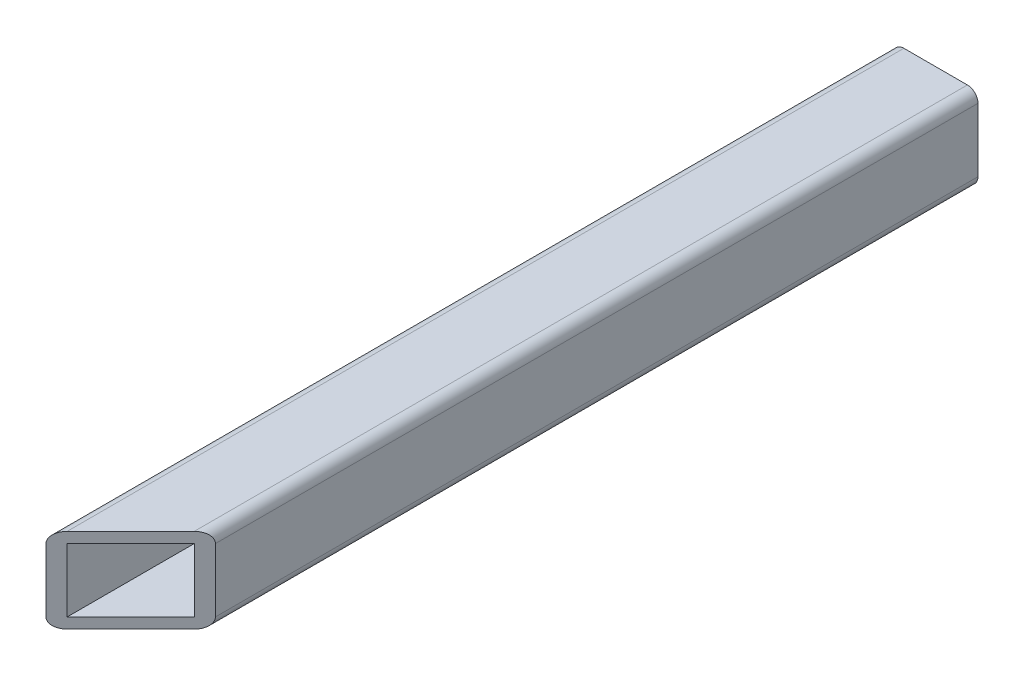
ISO-10303-21;
HEADER;
FILE_DESCRIPTION(('STEP AP214'),'2;1');
FILE_NAME('part.step','',(''),(''),'','','');
FILE_SCHEMA(('AUTOMOTIVE_DESIGN { 1 0 10303 214 1 1 1 1 }'));
ENDSEC;
DATA;
#1=APPLICATION_CONTEXT('core data for automotive mechanical design processes');
#2=APPLICATION_PROTOCOL_DEFINITION('international standard','automotive_design',2000,#1);
#3=PRODUCT_CONTEXT('',#1,'mechanical');
#4=PRODUCT('Part','Part','',(#3));
#5=PRODUCT_RELATED_PRODUCT_CATEGORY('part','',(#4));
#6=PRODUCT_DEFINITION_FORMATION('','',#4);
#7=PRODUCT_DEFINITION_CONTEXT('part definition',#1,'design');
#8=PRODUCT_DEFINITION('design','',#6,#7);
#9=PRODUCT_DEFINITION_SHAPE('','',#8);
#10=(LENGTH_UNIT() NAMED_UNIT(*) SI_UNIT(.MILLI.,.METRE.));
#11=(NAMED_UNIT(*) PLANE_ANGLE_UNIT() SI_UNIT($,.RADIAN.));
#12=(NAMED_UNIT(*) SI_UNIT($,.STERADIAN.) SOLID_ANGLE_UNIT());
#13=UNCERTAINTY_MEASURE_WITH_UNIT(LENGTH_MEASURE(1.E-05),#10,'distance_accuracy_value','');
#14=(GEOMETRIC_REPRESENTATION_CONTEXT(3) GLOBAL_UNCERTAINTY_ASSIGNED_CONTEXT((#13)) GLOBAL_UNIT_ASSIGNED_CONTEXT((#10,
#11,#12)) REPRESENTATION_CONTEXT('',''));
#15=CARTESIAN_POINT('',(0.,0.,0.));
#16=DIRECTION('',(0.,0.,1.));
#17=DIRECTION('',(1.,0.,0.));
#18=AXIS2_PLACEMENT_3D('',#15,#16,#17);
#19=CARTESIAN_POINT('',(0.,0.,0.));
#20=DIRECTION('',(0.,0.,-1.));
#21=DIRECTION('',(-1.,0.,0.));
#22=AXIS2_PLACEMENT_3D('',#19,#20,#21);
#23=PLANE('',#22);
#24=DIRECTION('',(0.,1.,0.));
#25=VECTOR('',#24,1.);
#26=CARTESIAN_POINT('',(12.7,0.,0.));
#27=LINE('',#26,#25);
#28=CARTESIAN_POINT('',(12.7,1.5875,0.));
#29=VERTEX_POINT('',#28);
#30=CARTESIAN_POINT('',(12.7,11.1125,0.));
#31=VERTEX_POINT('',#30);
#32=EDGE_CURVE('E179',#29,#31,#27,.T.);
#33=ORIENTED_EDGE('',*,*,#32,.F.);
#34=CARTESIAN_POINT('',(11.1125,1.5875,0.));
#35=DIRECTION('',(0.,0.,-1.));
#36=DIRECTION('',(-1.,0.,0.));
#37=AXIS2_PLACEMENT_3D('',#34,#35,#36);
#38=CIRCLE('',#37,1.5875);
#39=CARTESIAN_POINT('',(11.1125,0.,0.));
#40=VERTEX_POINT('',#39);
#41=EDGE_CURVE('E201',#29,#40,#38,.T.);
#42=ORIENTED_EDGE('',*,*,#41,.T.);
#43=DIRECTION('',(1.,0.,0.));
#44=VECTOR('',#43,1.);
#45=CARTESIAN_POINT('',(0.,0.,0.));
#46=LINE('',#45,#44);
#47=CARTESIAN_POINT('',(1.5875,0.,0.));
#48=VERTEX_POINT('',#47);
#49=EDGE_CURVE('E175',#48,#40,#46,.T.);
#50=ORIENTED_EDGE('',*,*,#49,.F.);
#51=CARTESIAN_POINT('',(1.5875,1.5875,0.));
#52=DIRECTION('',(0.,0.,-1.));
#53=DIRECTION('',(-1.,0.,0.));
#54=AXIS2_PLACEMENT_3D('',#51,#52,#53);
#55=CIRCLE('',#54,1.5875);
#56=CARTESIAN_POINT('',(0.,1.5875,0.));
#57=VERTEX_POINT('',#56);
#58=EDGE_CURVE('E198',#48,#57,#55,.T.);
#59=ORIENTED_EDGE('',*,*,#58,.T.);
#60=DIRECTION('',(0.,-1.,0.));
#61=VECTOR('',#60,1.);
#62=CARTESIAN_POINT('',(0.,0.,0.));
#63=LINE('',#62,#61);
#64=CARTESIAN_POINT('',(0.,11.1125,0.));
#65=VERTEX_POINT('',#64);
#66=EDGE_CURVE('E169',#65,#57,#63,.T.);
#67=ORIENTED_EDGE('',*,*,#66,.F.);
#68=CARTESIAN_POINT('',(1.5875,11.1125,0.));
#69=DIRECTION('',(0.,0.,-1.));
#70=DIRECTION('',(-1.,0.,0.));
#71=AXIS2_PLACEMENT_3D('',#68,#69,#70);
#72=CIRCLE('',#71,1.5875);
#73=CARTESIAN_POINT('',(1.5875,12.7,0.));
#74=VERTEX_POINT('',#73);
#75=EDGE_CURVE('E195',#65,#74,#72,.T.);
#76=ORIENTED_EDGE('',*,*,#75,.T.);
#77=DIRECTION('',(-1.,0.,0.));
#78=VECTOR('',#77,1.);
#79=CARTESIAN_POINT('',(0.,12.7,0.));
#80=LINE('',#79,#78);
#81=CARTESIAN_POINT('',(11.1125,12.7,0.));
#82=VERTEX_POINT('',#81);
#83=EDGE_CURVE('E172',#82,#74,#80,.T.);
#84=ORIENTED_EDGE('',*,*,#83,.F.);
#85=CARTESIAN_POINT('',(11.1125,11.1125,0.));
#86=DIRECTION('',(0.,0.,-1.));
#87=DIRECTION('',(-1.,0.,0.));
#88=AXIS2_PLACEMENT_3D('',#85,#86,#87);
#89=CIRCLE('',#88,1.5875);
#90=EDGE_CURVE('E192',#82,#31,#89,.T.);
#91=ORIENTED_EDGE('',*,*,#90,.T.);
#92=EDGE_LOOP('',(#33,#42,#50,#59,#67,#76,#84,#91));
#93=FACE_BOUND('',#92,.T.);
#94=DIRECTION('',(1.,0.,0.));
#95=VECTOR('',#94,1.);
#96=CARTESIAN_POINT('',(11.1125,1.5875,0.));
#97=LINE('',#96,#95);
#98=CARTESIAN_POINT('',(1.5875,1.5875,0.));
#99=VERTEX_POINT('',#98);
#100=CARTESIAN_POINT('',(11.1125,1.5875,0.));
#101=VERTEX_POINT('',#100);
#102=EDGE_CURVE('E155',#99,#101,#97,.T.);
#103=ORIENTED_EDGE('',*,*,#102,.T.);
#104=DIRECTION('',(0.,1.,0.));
#105=VECTOR('',#104,1.);
#106=CARTESIAN_POINT('',(11.1125,11.1125,0.));
#107=LINE('',#106,#105);
#108=CARTESIAN_POINT('',(11.1125,11.1125,0.));
#109=VERTEX_POINT('',#108);
#110=EDGE_CURVE('E276',#101,#109,#107,.T.);
#111=ORIENTED_EDGE('',*,*,#110,.T.);
#112=DIRECTION('',(-1.,0.,0.));
#113=VECTOR('',#112,1.);
#114=CARTESIAN_POINT('',(11.1125,11.1125,0.));
#115=LINE('',#114,#113);
#116=CARTESIAN_POINT('',(1.5875,11.1125,0.));
#117=VERTEX_POINT('',#116);
#118=EDGE_CURVE('E280',#109,#117,#115,.T.);
#119=ORIENTED_EDGE('',*,*,#118,.T.);
#120=DIRECTION('',(0.,-1.,0.));
#121=VECTOR('',#120,1.);
#122=CARTESIAN_POINT('',(1.5875,11.1125,0.));
#123=LINE('',#122,#121);
#124=EDGE_CURVE('E284',#117,#99,#123,.T.);
#125=ORIENTED_EDGE('',*,*,#124,.T.);
#126=EDGE_LOOP('',(#103,#111,#119,#125));
#127=FACE_BOUND('',#126,.T.);
#128=ADVANCED_FACE('F38',(#93,#127),#23,.T.);
#129=CARTESIAN_POINT('',(0.,0.,127.));
#130=DIRECTION('',(1.,0.,0.));
#131=DIRECTION('',(0.,0.,-1.));
#132=AXIS2_PLACEMENT_3D('',#129,#130,#131);
#133=PLANE('',#132);
#134=ORIENTED_EDGE('',*,*,#66,.T.);
#135=DIRECTION('',(0.,0.,-1.));
#136=VECTOR('',#135,1.);
#137=CARTESIAN_POINT('',(0.,1.5875,127.));
#138=LINE('',#137,#136);
#139=CARTESIAN_POINT('',(0.,1.5875,127.));
#140=VERTEX_POINT('',#139);
#141=EDGE_CURVE('E54',#57,#140,#138,.F.);
#142=ORIENTED_EDGE('',*,*,#141,.T.);
#143=DIRECTION('',(0.,-1.,0.));
#144=VECTOR('',#143,1.);
#145=CARTESIAN_POINT('',(0.,0.,127.));
#146=LINE('',#145,#144);
#147=CARTESIAN_POINT('',(0.,11.1125,127.));
#148=VERTEX_POINT('',#147);
#149=EDGE_CURVE('E140',#148,#140,#146,.T.);
#150=ORIENTED_EDGE('',*,*,#149,.F.);
#151=DIRECTION('',(0.,0.,-1.));
#152=VECTOR('',#151,1.);
#153=CARTESIAN_POINT('',(0.,11.1125,127.));
#154=LINE('',#153,#152);
#155=EDGE_CURVE('E222',#148,#65,#154,.T.);
#156=ORIENTED_EDGE('',*,*,#155,.T.);
#157=EDGE_LOOP('',(#134,#142,#150,#156));
#158=FACE_BOUND('',#157,.T.);
#159=ADVANCED_FACE('F245',(#158),#133,.F.);
#160=CARTESIAN_POINT('',(0.,0.,127.));
#161=DIRECTION('',(0.,1.,0.));
#162=DIRECTION('',(0.,0.,1.));
#163=AXIS2_PLACEMENT_3D('',#160,#161,#162);
#164=PLANE('',#163);
#165=ORIENTED_EDGE('',*,*,#49,.T.);
#166=DIRECTION('',(0.,0.,-1.));
#167=VECTOR('',#166,1.);
#168=CARTESIAN_POINT('',(11.1125,0.,127.));
#169=LINE('',#168,#167);
#170=CARTESIAN_POINT('',(11.1125,0.,115.8875));
#171=VERTEX_POINT('',#170);
#172=EDGE_CURVE('E208',#40,#171,#169,.F.);
#173=ORIENTED_EDGE('',*,*,#172,.T.);
#174=DIRECTION('',(-0.707106781186547,0.,0.707106781186548));
#175=VECTOR('',#174,1.);
#176=CARTESIAN_POINT('',(12.7,0.,114.3));
#177=LINE('',#176,#175);
#178=CARTESIAN_POINT('',(1.5875,0.,125.4125));
#179=VERTEX_POINT('',#178);
#180=EDGE_CURVE('E256',#171,#179,#177,.T.);
#181=ORIENTED_EDGE('',*,*,#180,.T.);
#182=DIRECTION('',(0.,0.,-1.));
#183=VECTOR('',#182,1.);
#184=CARTESIAN_POINT('',(1.5875,0.,127.));
#185=LINE('',#184,#183);
#186=EDGE_CURVE('E204',#179,#48,#185,.T.);
#187=ORIENTED_EDGE('',*,*,#186,.T.);
#188=EDGE_LOOP('',(#165,#173,#181,#187));
#189=FACE_BOUND('',#188,.T.);
#190=ADVANCED_FACE('F254',(#189),#164,.F.);
#191=CARTESIAN_POINT('',(12.7,0.,127.));
#192=DIRECTION('',(-1.,0.,0.));
#193=DIRECTION('',(0.,0.,1.));
#194=AXIS2_PLACEMENT_3D('',#191,#192,#193);
#195=PLANE('',#194);
#196=DIRECTION('',(0.,1.,0.));
#197=VECTOR('',#196,1.);
#198=CARTESIAN_POINT('',(12.7,0.,114.3));
#199=LINE('',#198,#197);
#200=CARTESIAN_POINT('',(12.7,1.5875,114.3));
#201=VERTEX_POINT('',#200);
#202=CARTESIAN_POINT('',(12.7,11.1125,114.3));
#203=VERTEX_POINT('',#202);
#204=EDGE_CURVE('E151',#201,#203,#199,.T.);
#205=ORIENTED_EDGE('',*,*,#204,.F.);
#206=DIRECTION('',(0.,0.,-1.));
#207=VECTOR('',#206,1.);
#208=CARTESIAN_POINT('',(12.7,1.5875,127.));
#209=LINE('',#208,#207);
#210=EDGE_CURVE('E188',#201,#29,#209,.T.);
#211=ORIENTED_EDGE('',*,*,#210,.T.);
#212=ORIENTED_EDGE('',*,*,#32,.T.);
#213=DIRECTION('',(0.,0.,-1.));
#214=VECTOR('',#213,1.);
#215=CARTESIAN_POINT('',(12.7,11.1125,127.));
#216=LINE('',#215,#214);
#217=EDGE_CURVE('E139',#31,#203,#216,.F.);
#218=ORIENTED_EDGE('',*,*,#217,.T.);
#219=EDGE_LOOP('',(#205,#211,#212,#218));
#220=FACE_BOUND('',#219,.T.);
#221=ADVANCED_FACE('F263',(#220),#195,.F.);
#222=CARTESIAN_POINT('',(0.,12.7,127.));
#223=DIRECTION('',(0.,-1.,0.));
#224=DIRECTION('',(1.,0.,0.));
#225=AXIS2_PLACEMENT_3D('',#222,#223,#224);
#226=PLANE('',#225);
#227=ORIENTED_EDGE('',*,*,#83,.T.);
#228=DIRECTION('',(0.,0.,-1.));
#229=VECTOR('',#228,1.);
#230=CARTESIAN_POINT('',(1.5875,12.7,127.));
#231=LINE('',#230,#229);
#232=CARTESIAN_POINT('',(1.58749999999999,12.7,125.4125));
#233=VERTEX_POINT('',#232);
#234=EDGE_CURVE('E11',#74,#233,#231,.F.);
#235=ORIENTED_EDGE('',*,*,#234,.T.);
#236=DIRECTION('',(-0.707106781186547,0.,0.707106781186548));
#237=VECTOR('',#236,1.);
#238=CARTESIAN_POINT('',(12.7,12.7,114.3));
#239=LINE('',#238,#237);
#240=CARTESIAN_POINT('',(11.1125,12.7,115.8875));
#241=VERTEX_POINT('',#240);
#242=EDGE_CURVE('E235',#241,#233,#239,.T.);
#243=ORIENTED_EDGE('',*,*,#242,.F.);
#244=DIRECTION('',(0.,0.,-1.));
#245=VECTOR('',#244,1.);
#246=CARTESIAN_POINT('',(11.1125,12.7,127.));
#247=LINE('',#246,#245);
#248=EDGE_CURVE('E47',#241,#82,#247,.T.);
#249=ORIENTED_EDGE('',*,*,#248,.T.);
#250=EDGE_LOOP('',(#227,#235,#243,#249));
#251=FACE_BOUND('',#250,.T.);
#252=ADVANCED_FACE('F233',(#251),#226,.F.);
#253=CARTESIAN_POINT('',(11.1125,11.1125,127.));
#254=DIRECTION('',(-1.,0.,0.));
#255=DIRECTION('',(0.,-1.,0.));
#256=AXIS2_PLACEMENT_3D('',#253,#254,#255);
#257=PLANE('',#256);
#258=DIRECTION('',(0.,-1.,0.));
#259=VECTOR('',#258,1.);
#260=CARTESIAN_POINT('',(11.1125,11.1125,115.8875));
#261=LINE('',#260,#259);
#262=CARTESIAN_POINT('',(11.1125,11.1125,115.8875));
#263=VERTEX_POINT('',#262);
#264=CARTESIAN_POINT('',(11.1125,1.5875,115.8875));
#265=VERTEX_POINT('',#264);
#266=EDGE_CURVE('E134',#263,#265,#261,.T.);
#267=ORIENTED_EDGE('',*,*,#266,.F.);
#268=DIRECTION('',(0.,0.,-1.));
#269=VECTOR('',#268,1.);
#270=CARTESIAN_POINT('',(11.1125,11.1125,127.));
#271=LINE('',#270,#269);
#272=EDGE_CURVE('E162',#263,#109,#271,.T.);
#273=ORIENTED_EDGE('',*,*,#272,.T.);
#274=ORIENTED_EDGE('',*,*,#110,.F.);
#275=DIRECTION('',(0.,0.,-1.));
#276=VECTOR('',#275,1.);
#277=CARTESIAN_POINT('',(11.1125,1.5875,127.));
#278=LINE('',#277,#276);
#279=EDGE_CURVE('E158',#265,#101,#278,.T.);
#280=ORIENTED_EDGE('',*,*,#279,.F.);
#281=EDGE_LOOP('',(#267,#273,#274,#280));
#282=FACE_BOUND('',#281,.T.);
#283=ADVANCED_FACE('F293',(#282),#257,.T.);
#284=CARTESIAN_POINT('',(11.1125,11.1125,127.));
#285=DIRECTION('',(0.,-1.,0.));
#286=DIRECTION('',(1.,0.,0.));
#287=AXIS2_PLACEMENT_3D('',#284,#285,#286);
#288=PLANE('',#287);
#289=DIRECTION('',(0.707106781186547,0.,-0.707106781186548));
#290=VECTOR('',#289,1.);
#291=CARTESIAN_POINT('',(5.55625,11.1125,121.44375));
#292=LINE('',#291,#290);
#293=CARTESIAN_POINT('',(1.5875,11.1125,125.4125));
#294=VERTEX_POINT('',#293);
#295=EDGE_CURVE('E150',#294,#263,#292,.T.);
#296=ORIENTED_EDGE('',*,*,#295,.F.);
#297=DIRECTION('',(0.,0.,-1.));
#298=VECTOR('',#297,1.);
#299=CARTESIAN_POINT('',(1.5875,11.1125,127.));
#300=LINE('',#299,#298);
#301=EDGE_CURVE('E148',#294,#117,#300,.T.);
#302=ORIENTED_EDGE('',*,*,#301,.T.);
#303=ORIENTED_EDGE('',*,*,#118,.F.);
#304=ORIENTED_EDGE('',*,*,#272,.F.);
#305=EDGE_LOOP('',(#296,#302,#303,#304));
#306=FACE_BOUND('',#305,.T.);
#307=ADVANCED_FACE('F291',(#306),#288,.T.);
#308=CARTESIAN_POINT('',(1.5875,11.1125,127.));
#309=DIRECTION('',(1.,0.,0.));
#310=DIRECTION('',(0.,1.,0.));
#311=AXIS2_PLACEMENT_3D('',#308,#309,#310);
#312=PLANE('',#311);
#313=DIRECTION('',(0.,1.,0.));
#314=VECTOR('',#313,1.);
#315=CARTESIAN_POINT('',(1.5875,11.1125,125.4125));
#316=LINE('',#315,#314);
#317=CARTESIAN_POINT('',(1.5875,1.5875,125.4125));
#318=VERTEX_POINT('',#317);
#319=EDGE_CURVE('E131',#318,#294,#316,.T.);
#320=ORIENTED_EDGE('',*,*,#319,.F.);
#321=DIRECTION('',(0.,0.,-1.));
#322=VECTOR('',#321,1.);
#323=CARTESIAN_POINT('',(1.5875,1.5875,127.));
#324=LINE('',#323,#322);
#325=EDGE_CURVE('E146',#318,#99,#324,.T.);
#326=ORIENTED_EDGE('',*,*,#325,.T.);
#327=ORIENTED_EDGE('',*,*,#124,.F.);
#328=ORIENTED_EDGE('',*,*,#301,.F.);
#329=EDGE_LOOP('',(#320,#326,#327,#328));
#330=FACE_BOUND('',#329,.T.);
#331=ADVANCED_FACE('F144',(#330),#312,.T.);
#332=CARTESIAN_POINT('',(11.1125,1.5875,127.));
#333=DIRECTION('',(0.,1.,0.));
#334=DIRECTION('',(-1.,0.,0.));
#335=AXIS2_PLACEMENT_3D('',#332,#333,#334);
#336=PLANE('',#335);
#337=DIRECTION('',(-0.707106781186547,0.,0.707106781186548));
#338=VECTOR('',#337,1.);
#339=CARTESIAN_POINT('',(5.55625,1.5875,121.44375));
#340=LINE('',#339,#338);
#341=EDGE_CURVE('E128',#265,#318,#340,.T.);
#342=ORIENTED_EDGE('',*,*,#341,.F.);
#343=ORIENTED_EDGE('',*,*,#279,.T.);
#344=ORIENTED_EDGE('',*,*,#102,.F.);
#345=ORIENTED_EDGE('',*,*,#325,.F.);
#346=EDGE_LOOP('',(#342,#343,#344,#345));
#347=FACE_BOUND('',#346,.T.);
#348=ADVANCED_FACE('F153',(#347),#336,.T.);
#349=CARTESIAN_POINT('',(12.7,0.,114.3));
#350=DIRECTION('',(-0.707106781186548,0.,-0.707106781186547));
#351=DIRECTION('',(-0.707106781186547,0.,0.707106781186548));
#352=AXIS2_PLACEMENT_3D('',#349,#350,#351);
#353=PLANE('',#352);
#354=ORIENTED_EDGE('',*,*,#266,.T.);
#355=ORIENTED_EDGE('',*,*,#341,.T.);
#356=ORIENTED_EDGE('',*,*,#319,.T.);
#357=ORIENTED_EDGE('',*,*,#295,.T.);
#358=EDGE_LOOP('',(#354,#355,#356,#357));
#359=FACE_BOUND('',#358,.T.);
#360=ORIENTED_EDGE('',*,*,#180,.F.);
#361=CARTESIAN_POINT('',(11.1125,1.5875,115.8875));
#362=DIRECTION('',(-0.707106781186548,0.,-0.707106781186547));
#363=DIRECTION('',(0.707106781186547,0.,-0.707106781186548));
#364=AXIS2_PLACEMENT_3D('',#361,#362,#363);
#365=ELLIPSE('',#364,2.24506403026729,1.5875);
#366=EDGE_CURVE('E219',#171,#201,#365,.F.);
#367=ORIENTED_EDGE('',*,*,#366,.T.);
#368=ORIENTED_EDGE('',*,*,#204,.T.);
#369=CARTESIAN_POINT('',(11.1125,11.1125,115.8875));
#370=DIRECTION('',(-0.707106781186548,0.,-0.707106781186547));
#371=DIRECTION('',(0.707106781186547,0.,-0.707106781186548));
#372=AXIS2_PLACEMENT_3D('',#369,#370,#371);
#373=ELLIPSE('',#372,2.24506403026729,1.5875);
#374=EDGE_CURVE('E211',#203,#241,#373,.F.);
#375=ORIENTED_EDGE('',*,*,#374,.T.);
#376=ORIENTED_EDGE('',*,*,#242,.T.);
#377=CARTESIAN_POINT('',(1.5875,11.1125,125.4125));
#378=DIRECTION('',(-0.707106781186548,0.,-0.707106781186547));
#379=DIRECTION('',(0.707106781186547,0.,-0.707106781186548));
#380=AXIS2_PLACEMENT_3D('',#377,#378,#379);
#381=ELLIPSE('',#380,2.24506403026729,1.5875);
#382=EDGE_CURVE('E61',#233,#148,#381,.F.);
#383=ORIENTED_EDGE('',*,*,#382,.T.);
#384=ORIENTED_EDGE('',*,*,#149,.T.);
#385=CARTESIAN_POINT('',(1.5875,1.5875,125.4125));
#386=DIRECTION('',(-0.707106781186548,0.,-0.707106781186547));
#387=DIRECTION('',(0.707106781186547,0.,-0.707106781186548));
#388=AXIS2_PLACEMENT_3D('',#385,#386,#387);
#389=ELLIPSE('',#388,2.24506403026729,1.5875);
#390=EDGE_CURVE('E216',#140,#179,#389,.F.);
#391=ORIENTED_EDGE('',*,*,#390,.T.);
#392=EDGE_LOOP('',(#360,#367,#368,#375,#376,#383,#384,#391));
#393=FACE_BOUND('',#392,.T.);
#394=ADVANCED_FACE('F130',(#359,#393),#353,.F.);
#395=CARTESIAN_POINT('',(11.1125,1.5875,127.));
#396=DIRECTION('',(0.,0.,-1.));
#397=DIRECTION('',(-1.,0.,0.));
#398=AXIS2_PLACEMENT_3D('',#395,#396,#397);
#399=CYLINDRICAL_SURFACE('',#398,1.5875);
#400=ORIENTED_EDGE('',*,*,#366,.F.);
#401=ORIENTED_EDGE('',*,*,#172,.F.);
#402=ORIENTED_EDGE('',*,*,#41,.F.);
#403=ORIENTED_EDGE('',*,*,#210,.F.);
#404=EDGE_LOOP('',(#400,#401,#402,#403));
#405=FACE_BOUND('',#404,.T.);
#406=ADVANCED_FACE('F260',(#405),#399,.T.);
#407=CARTESIAN_POINT('',(1.5875,1.5875,127.));
#408=DIRECTION('',(0.,0.,-1.));
#409=DIRECTION('',(-1.,0.,0.));
#410=AXIS2_PLACEMENT_3D('',#407,#408,#409);
#411=CYLINDRICAL_SURFACE('',#410,1.5875);
#412=ORIENTED_EDGE('',*,*,#390,.F.);
#413=ORIENTED_EDGE('',*,*,#141,.F.);
#414=ORIENTED_EDGE('',*,*,#58,.F.);
#415=ORIENTED_EDGE('',*,*,#186,.F.);
#416=EDGE_LOOP('',(#412,#413,#414,#415));
#417=FACE_BOUND('',#416,.T.);
#418=ADVANCED_FACE('F251',(#417),#411,.T.);
#419=CARTESIAN_POINT('',(1.5875,11.1125,127.));
#420=DIRECTION('',(0.,0.,-1.));
#421=DIRECTION('',(-1.,0.,0.));
#422=AXIS2_PLACEMENT_3D('',#419,#420,#421);
#423=CYLINDRICAL_SURFACE('',#422,1.5875);
#424=ORIENTED_EDGE('',*,*,#382,.F.);
#425=ORIENTED_EDGE('',*,*,#234,.F.);
#426=ORIENTED_EDGE('',*,*,#75,.F.);
#427=ORIENTED_EDGE('',*,*,#155,.F.);
#428=EDGE_LOOP('',(#424,#425,#426,#427));
#429=FACE_BOUND('',#428,.T.);
#430=ADVANCED_FACE('F244',(#429),#423,.T.);
#431=CARTESIAN_POINT('',(11.1125,11.1125,127.));
#432=DIRECTION('',(0.,0.,-1.));
#433=DIRECTION('',(-1.,0.,0.));
#434=AXIS2_PLACEMENT_3D('',#431,#432,#433);
#435=CYLINDRICAL_SURFACE('',#434,1.5875);
#436=ORIENTED_EDGE('',*,*,#374,.F.);
#437=ORIENTED_EDGE('',*,*,#217,.F.);
#438=ORIENTED_EDGE('',*,*,#90,.F.);
#439=ORIENTED_EDGE('',*,*,#248,.F.);
#440=EDGE_LOOP('',(#436,#437,#438,#439));
#441=FACE_BOUND('',#440,.T.);
#442=ADVANCED_FACE('F40',(#441),#435,.T.);
#443=CLOSED_SHELL('',(#128,#159,#190,#221,#252,#283,#307,#331,#348,#394,#406,#418,#430,#442));
#444=MANIFOLD_SOLID_BREP('B2',#443);
#445=ADVANCED_BREP_SHAPE_REPRESENTATION('',(#18,#444),#14);
#446=SHAPE_DEFINITION_REPRESENTATION(#9,#445);
ENDSEC;
END-ISO-10303-21;
